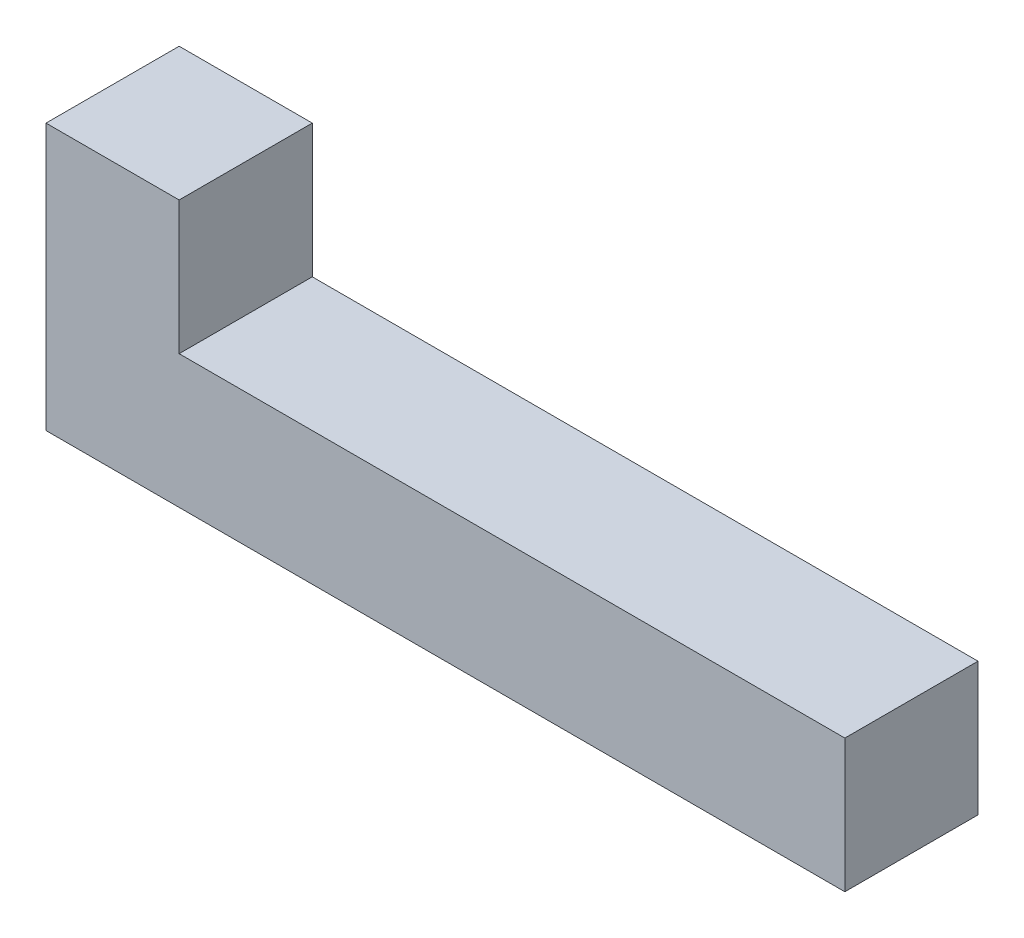
ISO-10303-21;
HEADER;
FILE_DESCRIPTION(('STEP AP214'),'2;1');
FILE_NAME('part.step','',(''),(''),'','','');
FILE_SCHEMA(('AUTOMOTIVE_DESIGN { 1 0 10303 214 1 1 1 1 }'));
ENDSEC;
DATA;
#1=APPLICATION_CONTEXT('core data for automotive mechanical design processes');
#2=APPLICATION_PROTOCOL_DEFINITION('international standard','automotive_design',2000,#1);
#3=PRODUCT_CONTEXT('',#1,'mechanical');
#4=PRODUCT('Part','Part','',(#3));
#5=PRODUCT_RELATED_PRODUCT_CATEGORY('part','',(#4));
#6=PRODUCT_DEFINITION_FORMATION('','',#4);
#7=PRODUCT_DEFINITION_CONTEXT('part definition',#1,'design');
#8=PRODUCT_DEFINITION('design','',#6,#7);
#9=PRODUCT_DEFINITION_SHAPE('','',#8);
#10=(LENGTH_UNIT() NAMED_UNIT(*) SI_UNIT(.MILLI.,.METRE.));
#11=(NAMED_UNIT(*) PLANE_ANGLE_UNIT() SI_UNIT($,.RADIAN.));
#12=(NAMED_UNIT(*) SI_UNIT($,.STERADIAN.) SOLID_ANGLE_UNIT());
#13=UNCERTAINTY_MEASURE_WITH_UNIT(LENGTH_MEASURE(1.E-05),#10,'distance_accuracy_value','');
#14=(GEOMETRIC_REPRESENTATION_CONTEXT(3) GLOBAL_UNCERTAINTY_ASSIGNED_CONTEXT((#13)) GLOBAL_UNIT_ASSIGNED_CONTEXT((#10,
#11,#12)) REPRESENTATION_CONTEXT('',''));
#15=CARTESIAN_POINT('',(0.,0.,0.));
#16=DIRECTION('',(0.,0.,1.));
#17=DIRECTION('',(1.,0.,0.));
#18=AXIS2_PLACEMENT_3D('',#15,#16,#17);
#19=CARTESIAN_POINT('',(0.,0.585056057493602,5.));
#20=DIRECTION('',(0.,1.,0.));
#21=DIRECTION('',(0.,0.,1.));
#22=AXIS2_PLACEMENT_3D('',#19,#20,#21);
#23=PLANE('',#22);
#24=DIRECTION('',(1.,0.,0.));
#25=VECTOR('',#24,1.);
#26=CARTESIAN_POINT('',(0.,0.585056057493602,0.));
#27=LINE('',#26,#25);
#28=CARTESIAN_POINT('',(-4.71756087732428,0.585056057493602,0.));
#29=VERTEX_POINT('',#28);
#30=CARTESIAN_POINT('',(25.2824391226757,0.585056057493602,0.));
#31=VERTEX_POINT('',#30);
#32=EDGE_CURVE('E119',#29,#31,#27,.T.);
#33=ORIENTED_EDGE('',*,*,#32,.T.);
#34=DIRECTION('',(0.,0.,-1.));
#35=VECTOR('',#34,1.);
#36=CARTESIAN_POINT('',(25.2824391226757,0.585056057493602,5.));
#37=LINE('',#36,#35);
#38=CARTESIAN_POINT('',(25.2824391226757,0.585056057493602,5.));
#39=VERTEX_POINT('',#38);
#40=EDGE_CURVE('E11',#39,#31,#37,.T.);
#41=ORIENTED_EDGE('',*,*,#40,.F.);
#42=DIRECTION('',(1.,0.,0.));
#43=VECTOR('',#42,1.);
#44=CARTESIAN_POINT('',(0.,0.585056057493602,5.));
#45=LINE('',#44,#43);
#46=CARTESIAN_POINT('',(-4.71756087732428,0.585056057493602,5.));
#47=VERTEX_POINT('',#46);
#48=EDGE_CURVE('E133',#47,#39,#45,.T.);
#49=ORIENTED_EDGE('',*,*,#48,.F.);
#50=DIRECTION('',(0.,0.,-1.));
#51=VECTOR('',#50,1.);
#52=CARTESIAN_POINT('',(-4.71756087732428,0.585056057493602,5.));
#53=LINE('',#52,#51);
#54=EDGE_CURVE('E51',#47,#29,#53,.T.);
#55=ORIENTED_EDGE('',*,*,#54,.T.);
#56=EDGE_LOOP('',(#33,#41,#49,#55));
#57=FACE_BOUND('',#56,.T.);
#58=ADVANCED_FACE('F35',(#57),#23,.F.);
#59=CARTESIAN_POINT('',(25.2824391226757,0.,5.));
#60=DIRECTION('',(-1.,0.,0.));
#61=DIRECTION('',(0.,0.,1.));
#62=AXIS2_PLACEMENT_3D('',#59,#60,#61);
#63=PLANE('',#62);
#64=DIRECTION('',(0.,1.,0.));
#65=VECTOR('',#64,1.);
#66=CARTESIAN_POINT('',(25.2824391226757,0.,0.));
#67=LINE('',#66,#65);
#68=CARTESIAN_POINT('',(25.2824391226757,5.5850560574936,0.));
#69=VERTEX_POINT('',#68);
#70=EDGE_CURVE('E121',#31,#69,#67,.T.);
#71=ORIENTED_EDGE('',*,*,#70,.T.);
#72=DIRECTION('',(0.,0.,-1.));
#73=VECTOR('',#72,1.);
#74=CARTESIAN_POINT('',(25.2824391226757,5.5850560574936,5.));
#75=LINE('',#74,#73);
#76=CARTESIAN_POINT('',(25.2824391226757,5.5850560574936,5.));
#77=VERTEX_POINT('',#76);
#78=EDGE_CURVE('E43',#77,#69,#75,.T.);
#79=ORIENTED_EDGE('',*,*,#78,.F.);
#80=DIRECTION('',(0.,1.,0.));
#81=VECTOR('',#80,1.);
#82=CARTESIAN_POINT('',(25.2824391226757,0.,5.));
#83=LINE('',#82,#81);
#84=EDGE_CURVE('E83',#39,#77,#83,.T.);
#85=ORIENTED_EDGE('',*,*,#84,.F.);
#86=ORIENTED_EDGE('',*,*,#40,.T.);
#87=EDGE_LOOP('',(#71,#79,#85,#86));
#88=FACE_BOUND('',#87,.T.);
#89=ADVANCED_FACE('F139',(#88),#63,.F.);
#90=CARTESIAN_POINT('',(0.,5.5850560574936,5.));
#91=DIRECTION('',(0.,1.,0.));
#92=DIRECTION('',(0.,0.,1.));
#93=AXIS2_PLACEMENT_3D('',#90,#91,#92);
#94=PLANE('',#93);
#95=DIRECTION('',(1.,0.,0.));
#96=VECTOR('',#95,1.);
#97=CARTESIAN_POINT('',(0.,5.5850560574936,0.));
#98=LINE('',#97,#96);
#99=CARTESIAN_POINT('',(0.28243912267572,5.5850560574936,0.));
#100=VERTEX_POINT('',#99);
#101=EDGE_CURVE('E124',#100,#69,#98,.T.);
#102=ORIENTED_EDGE('',*,*,#101,.F.);
#103=DIRECTION('',(0.,0.,-1.));
#104=VECTOR('',#103,1.);
#105=CARTESIAN_POINT('',(0.28243912267572,5.5850560574936,5.));
#106=LINE('',#105,#104);
#107=CARTESIAN_POINT('',(0.28243912267572,5.5850560574936,5.));
#108=VERTEX_POINT('',#107);
#109=EDGE_CURVE('E111',#108,#100,#106,.T.);
#110=ORIENTED_EDGE('',*,*,#109,.F.);
#111=DIRECTION('',(1.,0.,0.));
#112=VECTOR('',#111,1.);
#113=CARTESIAN_POINT('',(0.,5.5850560574936,5.));
#114=LINE('',#113,#112);
#115=EDGE_CURVE('E101',#108,#77,#114,.T.);
#116=ORIENTED_EDGE('',*,*,#115,.T.);
#117=ORIENTED_EDGE('',*,*,#78,.T.);
#118=EDGE_LOOP('',(#102,#110,#116,#117));
#119=FACE_BOUND('',#118,.T.);
#120=ADVANCED_FACE('F138',(#119),#94,.T.);
#121=CARTESIAN_POINT('',(0.28243912267572,0.,5.));
#122=DIRECTION('',(-1.,0.,0.));
#123=DIRECTION('',(0.,0.,1.));
#124=AXIS2_PLACEMENT_3D('',#121,#122,#123);
#125=PLANE('',#124);
#126=DIRECTION('',(0.,1.,0.));
#127=VECTOR('',#126,1.);
#128=CARTESIAN_POINT('',(0.28243912267572,0.,0.));
#129=LINE('',#128,#127);
#130=CARTESIAN_POINT('',(0.28243912267572,10.5850560574936,0.));
#131=VERTEX_POINT('',#130);
#132=EDGE_CURVE('E108',#100,#131,#129,.T.);
#133=ORIENTED_EDGE('',*,*,#132,.T.);
#134=DIRECTION('',(0.,0.,-1.));
#135=VECTOR('',#134,1.);
#136=CARTESIAN_POINT('',(0.28243912267572,10.5850560574936,5.));
#137=LINE('',#136,#135);
#138=CARTESIAN_POINT('',(0.28243912267572,10.5850560574936,5.));
#139=VERTEX_POINT('',#138);
#140=EDGE_CURVE('E105',#139,#131,#137,.T.);
#141=ORIENTED_EDGE('',*,*,#140,.F.);
#142=DIRECTION('',(0.,1.,0.));
#143=VECTOR('',#142,1.);
#144=CARTESIAN_POINT('',(0.28243912267572,0.,5.));
#145=LINE('',#144,#143);
#146=EDGE_CURVE('E94',#108,#139,#145,.T.);
#147=ORIENTED_EDGE('',*,*,#146,.F.);
#148=ORIENTED_EDGE('',*,*,#109,.T.);
#149=EDGE_LOOP('',(#133,#141,#147,#148));
#150=FACE_BOUND('',#149,.T.);
#151=ADVANCED_FACE('F106',(#150),#125,.F.);
#152=CARTESIAN_POINT('',(0.,10.5850560574936,5.));
#153=DIRECTION('',(0.,1.,0.));
#154=DIRECTION('',(0.,0.,1.));
#155=AXIS2_PLACEMENT_3D('',#152,#153,#154);
#156=PLANE('',#155);
#157=DIRECTION('',(1.,0.,0.));
#158=VECTOR('',#157,1.);
#159=CARTESIAN_POINT('',(0.,10.5850560574936,0.));
#160=LINE('',#159,#158);
#161=CARTESIAN_POINT('',(-4.71756087732428,10.5850560574936,0.));
#162=VERTEX_POINT('',#161);
#163=EDGE_CURVE('E128',#162,#131,#160,.T.);
#164=ORIENTED_EDGE('',*,*,#163,.F.);
#165=DIRECTION('',(0.,0.,-1.));
#166=VECTOR('',#165,1.);
#167=CARTESIAN_POINT('',(-4.71756087732428,10.5850560574936,5.));
#168=LINE('',#167,#166);
#169=CARTESIAN_POINT('',(-4.71756087732428,10.5850560574936,5.));
#170=VERTEX_POINT('',#169);
#171=EDGE_CURVE('E71',#170,#162,#168,.T.);
#172=ORIENTED_EDGE('',*,*,#171,.F.);
#173=DIRECTION('',(1.,0.,0.));
#174=VECTOR('',#173,1.);
#175=CARTESIAN_POINT('',(0.,10.5850560574936,5.));
#176=LINE('',#175,#174);
#177=EDGE_CURVE('E99',#170,#139,#176,.T.);
#178=ORIENTED_EDGE('',*,*,#177,.T.);
#179=ORIENTED_EDGE('',*,*,#140,.T.);
#180=EDGE_LOOP('',(#164,#172,#178,#179));
#181=FACE_BOUND('',#180,.T.);
#182=ADVANCED_FACE('F113',(#181),#156,.T.);
#183=CARTESIAN_POINT('',(-4.71756087732428,0.,5.));
#184=DIRECTION('',(-1.,0.,0.));
#185=DIRECTION('',(0.,0.,1.));
#186=AXIS2_PLACEMENT_3D('',#183,#184,#185);
#187=PLANE('',#186);
#188=DIRECTION('',(0.,1.,0.));
#189=VECTOR('',#188,1.);
#190=CARTESIAN_POINT('',(-4.71756087732428,0.,0.));
#191=LINE('',#190,#189);
#192=EDGE_CURVE('E130',#29,#162,#191,.T.);
#193=ORIENTED_EDGE('',*,*,#192,.F.);
#194=ORIENTED_EDGE('',*,*,#54,.F.);
#195=DIRECTION('',(0.,1.,0.));
#196=VECTOR('',#195,1.);
#197=CARTESIAN_POINT('',(-4.71756087732428,0.,5.));
#198=LINE('',#197,#196);
#199=EDGE_CURVE('E114',#47,#170,#198,.T.);
#200=ORIENTED_EDGE('',*,*,#199,.T.);
#201=ORIENTED_EDGE('',*,*,#171,.T.);
#202=EDGE_LOOP('',(#193,#194,#200,#201));
#203=FACE_BOUND('',#202,.T.);
#204=ADVANCED_FACE('F143',(#203),#187,.T.);
#205=CARTESIAN_POINT('',(0.,0.,5.));
#206=DIRECTION('',(0.,0.,1.));
#207=DIRECTION('',(1.,0.,0.));
#208=AXIS2_PLACEMENT_3D('',#205,#206,#207);
#209=PLANE('',#208);
#210=ORIENTED_EDGE('',*,*,#48,.T.);
#211=ORIENTED_EDGE('',*,*,#84,.T.);
#212=ORIENTED_EDGE('',*,*,#115,.F.);
#213=ORIENTED_EDGE('',*,*,#146,.T.);
#214=ORIENTED_EDGE('',*,*,#177,.F.);
#215=ORIENTED_EDGE('',*,*,#199,.F.);
#216=EDGE_LOOP('',(#210,#211,#212,#213,#214,#215));
#217=FACE_BOUND('',#216,.T.);
#218=ADVANCED_FACE('F96',(#217),#209,.T.);
#219=CARTESIAN_POINT('',(0.,0.,0.));
#220=DIRECTION('',(0.,0.,1.));
#221=DIRECTION('',(1.,0.,0.));
#222=AXIS2_PLACEMENT_3D('',#219,#220,#221);
#223=PLANE('',#222);
#224=ORIENTED_EDGE('',*,*,#32,.F.);
#225=ORIENTED_EDGE('',*,*,#192,.T.);
#226=ORIENTED_EDGE('',*,*,#163,.T.);
#227=ORIENTED_EDGE('',*,*,#132,.F.);
#228=ORIENTED_EDGE('',*,*,#101,.T.);
#229=ORIENTED_EDGE('',*,*,#70,.F.);
#230=EDGE_LOOP('',(#224,#225,#226,#227,#228,#229));
#231=FACE_BOUND('',#230,.T.);
#232=ADVANCED_FACE('F142',(#231),#223,.F.);
#233=CLOSED_SHELL('',(#58,#89,#120,#151,#182,#204,#218,#232));
#234=MANIFOLD_SOLID_BREP('B2',#233);
#235=ADVANCED_BREP_SHAPE_REPRESENTATION('',(#18,#234),#14);
#236=SHAPE_DEFINITION_REPRESENTATION(#9,#235);
ENDSEC;
END-ISO-10303-21;
